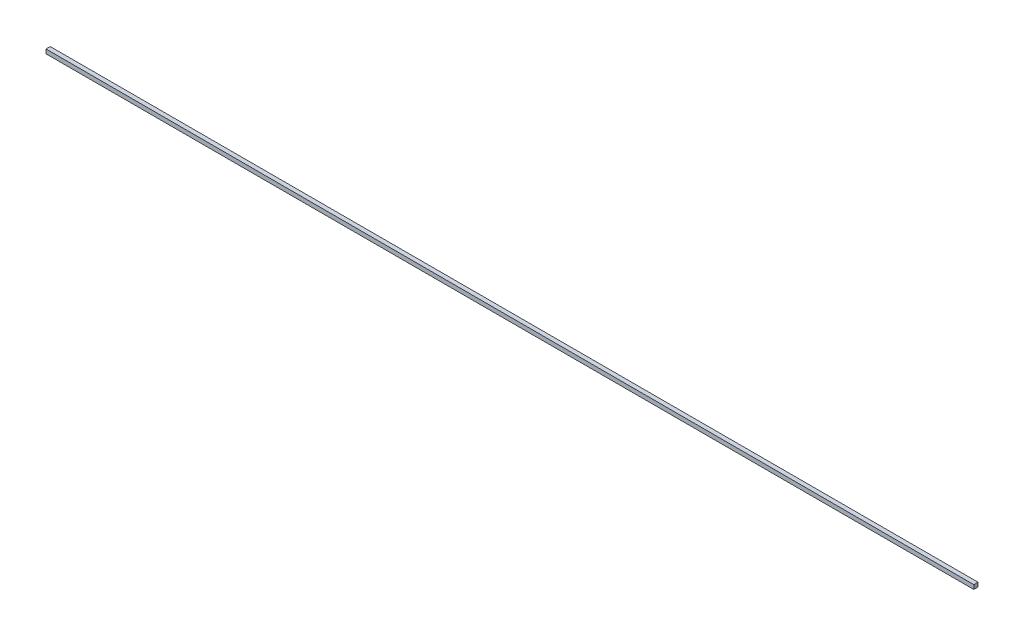
ISO-10303-21;
HEADER;
FILE_DESCRIPTION(('STEP AP214'),'2;1');
FILE_NAME('part.step','',(''),(''),'','','');
FILE_SCHEMA(('AUTOMOTIVE_DESIGN { 1 0 10303 214 1 1 1 1 }'));
ENDSEC;
DATA;
#1=APPLICATION_CONTEXT('core data for automotive mechanical design processes');
#2=APPLICATION_PROTOCOL_DEFINITION('international standard','automotive_design',2000,#1);
#3=PRODUCT_CONTEXT('',#1,'mechanical');
#4=PRODUCT('Part','Part','',(#3));
#5=PRODUCT_RELATED_PRODUCT_CATEGORY('part','',(#4));
#6=PRODUCT_DEFINITION_FORMATION('','',#4);
#7=PRODUCT_DEFINITION_CONTEXT('part definition',#1,'design');
#8=PRODUCT_DEFINITION('design','',#6,#7);
#9=PRODUCT_DEFINITION_SHAPE('','',#8);
#10=(LENGTH_UNIT() NAMED_UNIT(*) SI_UNIT(.MILLI.,.METRE.));
#11=(NAMED_UNIT(*) PLANE_ANGLE_UNIT() SI_UNIT($,.RADIAN.));
#12=(NAMED_UNIT(*) SI_UNIT($,.STERADIAN.) SOLID_ANGLE_UNIT());
#13=UNCERTAINTY_MEASURE_WITH_UNIT(LENGTH_MEASURE(1.E-05),#10,'distance_accuracy_value','');
#14=(GEOMETRIC_REPRESENTATION_CONTEXT(3) GLOBAL_UNCERTAINTY_ASSIGNED_CONTEXT((#13)) GLOBAL_UNIT_ASSIGNED_CONTEXT((#10,
#11,#12)) REPRESENTATION_CONTEXT('',''));
#15=CARTESIAN_POINT('',(0.,0.,0.));
#16=DIRECTION('',(0.,0.,1.));
#17=DIRECTION('',(1.,0.,0.));
#18=AXIS2_PLACEMENT_3D('',#15,#16,#17);
#19=CARTESIAN_POINT('',(597.266258042068,0.,0.));
#20=DIRECTION('',(-1.,0.,0.));
#21=DIRECTION('',(0.,0.,1.));
#22=AXIS2_PLACEMENT_3D('',#19,#20,#21);
#23=PLANE('',#22);
#24=DIRECTION('',(0.,0.,1.));
#25=VECTOR('',#24,1.);
#26=CARTESIAN_POINT('',(597.266258042068,-45.,0.));
#27=LINE('',#26,#25);
#28=CARTESIAN_POINT('',(597.266258042068,-45.,0.));
#29=VERTEX_POINT('',#28);
#30=CARTESIAN_POINT('',(597.266258042068,-45.,5.));
#31=VERTEX_POINT('',#30);
#32=EDGE_CURVE('E100',#29,#31,#27,.T.);
#33=ORIENTED_EDGE('',*,*,#32,.T.);
#34=DIRECTION('',(0.,-1.,0.));
#35=VECTOR('',#34,1.);
#36=CARTESIAN_POINT('',(597.266258042068,-45.,5.));
#37=LINE('',#36,#35);
#38=CARTESIAN_POINT('',(597.266258042068,-50.,5.));
#39=VERTEX_POINT('',#38);
#40=EDGE_CURVE('E42',#31,#39,#37,.T.);
#41=ORIENTED_EDGE('',*,*,#40,.T.);
#42=DIRECTION('',(0.,0.,-1.));
#43=VECTOR('',#42,1.);
#44=CARTESIAN_POINT('',(597.266258042068,-50.,80.));
#45=LINE('',#44,#43);
#46=CARTESIAN_POINT('',(597.266258042068,-50.,0.));
#47=VERTEX_POINT('',#46);
#48=EDGE_CURVE('E11',#39,#47,#45,.T.);
#49=ORIENTED_EDGE('',*,*,#48,.T.);
#50=DIRECTION('',(0.,-1.,0.));
#51=VECTOR('',#50,1.);
#52=CARTESIAN_POINT('',(597.266258042068,0.,0.));
#53=LINE('',#52,#51);
#54=EDGE_CURVE('E37',#29,#47,#53,.T.);
#55=ORIENTED_EDGE('',*,*,#54,.F.);
#56=EDGE_LOOP('',(#33,#41,#49,#55));
#57=FACE_BOUND('',#56,.T.);
#58=ADVANCED_FACE('F34',(#57),#23,.F.);
#59=CARTESIAN_POINT('',(-502.733741957931,0.,0.));
#60=DIRECTION('',(1.,0.,0.));
#61=DIRECTION('',(0.,0.,-1.));
#62=AXIS2_PLACEMENT_3D('',#59,#60,#61);
#63=PLANE('',#62);
#64=DIRECTION('',(0.,0.,-1.));
#65=VECTOR('',#64,1.);
#66=CARTESIAN_POINT('',(-502.733741957931,-50.,80.));
#67=LINE('',#66,#65);
#68=CARTESIAN_POINT('',(-502.733741957931,-50.,5.));
#69=VERTEX_POINT('',#68);
#70=CARTESIAN_POINT('',(-502.733741957931,-50.,0.));
#71=VERTEX_POINT('',#70);
#72=EDGE_CURVE('E80',#69,#71,#67,.T.);
#73=ORIENTED_EDGE('',*,*,#72,.F.);
#74=DIRECTION('',(0.,1.,0.));
#75=VECTOR('',#74,1.);
#76=CARTESIAN_POINT('',(-502.733741957931,-45.,5.));
#77=LINE('',#76,#75);
#78=CARTESIAN_POINT('',(-502.733741957931,-45.,5.));
#79=VERTEX_POINT('',#78);
#80=EDGE_CURVE('E97',#69,#79,#77,.T.);
#81=ORIENTED_EDGE('',*,*,#80,.T.);
#82=DIRECTION('',(0.,0.,-1.));
#83=VECTOR('',#82,1.);
#84=CARTESIAN_POINT('',(-502.733741957931,-45.,0.));
#85=LINE('',#84,#83);
#86=CARTESIAN_POINT('',(-502.733741957931,-45.,0.));
#87=VERTEX_POINT('',#86);
#88=EDGE_CURVE('E82',#79,#87,#85,.T.);
#89=ORIENTED_EDGE('',*,*,#88,.T.);
#90=DIRECTION('',(0.,1.,0.));
#91=VECTOR('',#90,1.);
#92=CARTESIAN_POINT('',(-502.733741957931,0.,0.));
#93=LINE('',#92,#91);
#94=EDGE_CURVE('E76',#71,#87,#93,.T.);
#95=ORIENTED_EDGE('',*,*,#94,.F.);
#96=EDGE_LOOP('',(#73,#81,#89,#95));
#97=FACE_BOUND('',#96,.T.);
#98=ADVANCED_FACE('F78',(#97),#63,.F.);
#99=CARTESIAN_POINT('',(0.,-45.,0.));
#100=DIRECTION('',(0.,1.,0.));
#101=DIRECTION('',(0.,0.,1.));
#102=AXIS2_PLACEMENT_3D('',#99,#100,#101);
#103=PLANE('',#102);
#104=ORIENTED_EDGE('',*,*,#32,.F.);
#105=DIRECTION('',(-1.,0.,0.));
#106=VECTOR('',#105,1.);
#107=CARTESIAN_POINT('',(-502.733741957931,-45.,0.));
#108=LINE('',#107,#106);
#109=EDGE_CURVE('E92',#29,#87,#108,.T.);
#110=ORIENTED_EDGE('',*,*,#109,.T.);
#111=ORIENTED_EDGE('',*,*,#88,.F.);
#112=DIRECTION('',(-1.,0.,0.));
#113=VECTOR('',#112,1.);
#114=CARTESIAN_POINT('',(597.266258042068,-45.,5.));
#115=LINE('',#114,#113);
#116=EDGE_CURVE('E90',#31,#79,#115,.T.);
#117=ORIENTED_EDGE('',*,*,#116,.F.);
#118=EDGE_LOOP('',(#104,#110,#111,#117));
#119=FACE_BOUND('',#118,.T.);
#120=ADVANCED_FACE('F106',(#119),#103,.T.);
#121=CARTESIAN_POINT('',(-502.733741957931,0.,0.));
#122=DIRECTION('',(0.,0.,1.));
#123=DIRECTION('',(1.,0.,0.));
#124=AXIS2_PLACEMENT_3D('',#121,#122,#123);
#125=PLANE('',#124);
#126=ORIENTED_EDGE('',*,*,#109,.F.);
#127=ORIENTED_EDGE('',*,*,#54,.T.);
#128=DIRECTION('',(1.,0.,0.));
#129=VECTOR('',#128,1.);
#130=CARTESIAN_POINT('',(-502.733741957931,-50.,0.));
#131=LINE('',#130,#129);
#132=EDGE_CURVE('E86',#71,#47,#131,.T.);
#133=ORIENTED_EDGE('',*,*,#132,.F.);
#134=ORIENTED_EDGE('',*,*,#94,.T.);
#135=EDGE_LOOP('',(#126,#127,#133,#134));
#136=FACE_BOUND('',#135,.T.);
#137=ADVANCED_FACE('F89',(#136),#125,.F.);
#138=CARTESIAN_POINT('',(-502.733741957931,-50.,80.));
#139=DIRECTION('',(0.,1.,0.));
#140=DIRECTION('',(0.,0.,1.));
#141=AXIS2_PLACEMENT_3D('',#138,#139,#140);
#142=PLANE('',#141);
#143=ORIENTED_EDGE('',*,*,#48,.F.);
#144=DIRECTION('',(-1.,0.,0.));
#145=VECTOR('',#144,1.);
#146=CARTESIAN_POINT('',(-502.733741957931,-50.,5.));
#147=LINE('',#146,#145);
#148=EDGE_CURVE('E83',#39,#69,#147,.T.);
#149=ORIENTED_EDGE('',*,*,#148,.T.);
#150=ORIENTED_EDGE('',*,*,#72,.T.);
#151=ORIENTED_EDGE('',*,*,#132,.T.);
#152=EDGE_LOOP('',(#143,#149,#150,#151));
#153=FACE_BOUND('',#152,.T.);
#154=ADVANCED_FACE('F85',(#153),#142,.F.);
#155=CARTESIAN_POINT('',(597.266258042068,-45.,5.));
#156=DIRECTION('',(0.,0.,1.));
#157=DIRECTION('',(1.,0.,0.));
#158=AXIS2_PLACEMENT_3D('',#155,#156,#157);
#159=PLANE('',#158);
#160=ORIENTED_EDGE('',*,*,#40,.F.);
#161=ORIENTED_EDGE('',*,*,#116,.T.);
#162=ORIENTED_EDGE('',*,*,#80,.F.);
#163=ORIENTED_EDGE('',*,*,#148,.F.);
#164=EDGE_LOOP('',(#160,#161,#162,#163));
#165=FACE_BOUND('',#164,.T.);
#166=ADVANCED_FACE('F108',(#165),#159,.T.);
#167=CLOSED_SHELL('',(#58,#98,#120,#137,#154,#166));
#168=MANIFOLD_SOLID_BREP('B2',#167);
#169=ADVANCED_BREP_SHAPE_REPRESENTATION('',(#18,#168),#14);
#170=SHAPE_DEFINITION_REPRESENTATION(#9,#169);
ENDSEC;
END-ISO-10303-21;
